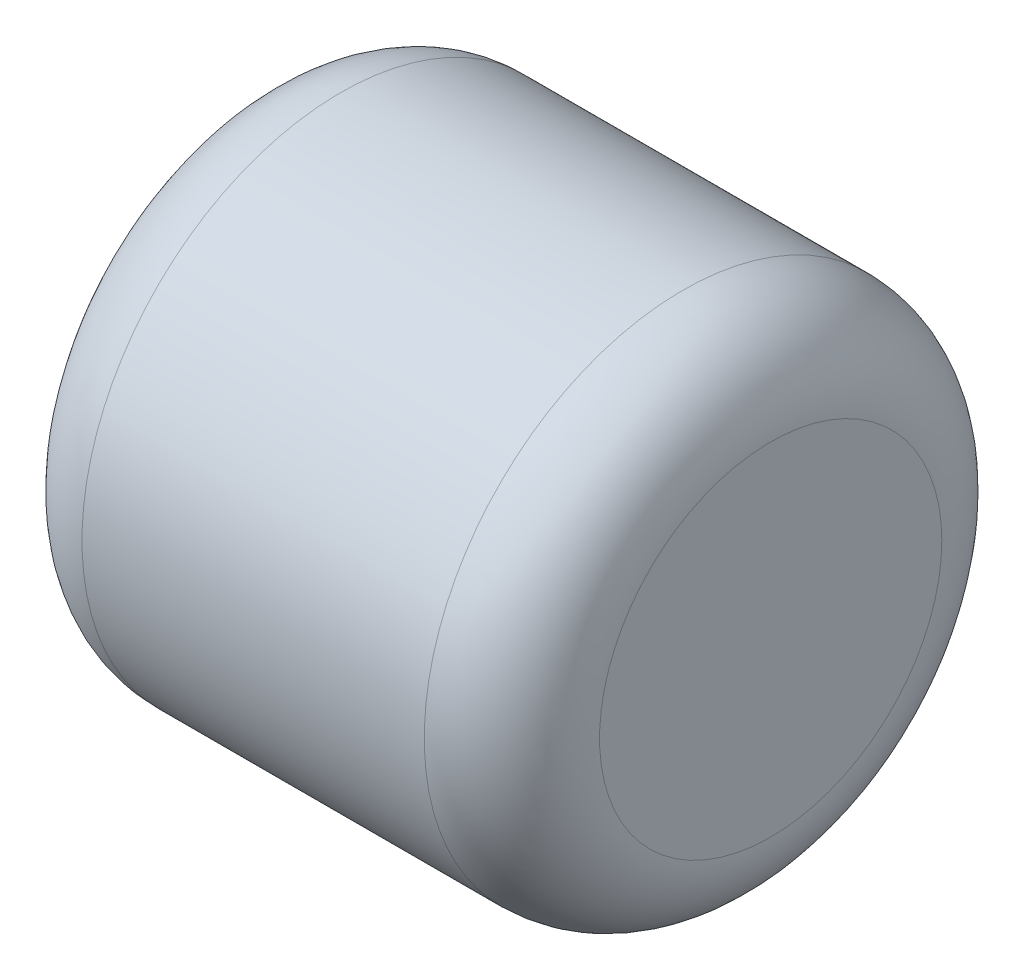
ISO-10303-21;
HEADER;
FILE_DESCRIPTION(('STEP AP214'),'2;1');
FILE_NAME('part.step','',(''),(''),'','','');
FILE_SCHEMA(('AUTOMOTIVE_DESIGN { 1 0 10303 214 1 1 1 1 }'));
ENDSEC;
DATA;
#1=APPLICATION_CONTEXT('core data for automotive mechanical design processes');
#2=APPLICATION_PROTOCOL_DEFINITION('international standard','automotive_design',2000,#1);
#3=PRODUCT_CONTEXT('',#1,'mechanical');
#4=PRODUCT('Part','Part','',(#3));
#5=PRODUCT_RELATED_PRODUCT_CATEGORY('part','',(#4));
#6=PRODUCT_DEFINITION_FORMATION('','',#4);
#7=PRODUCT_DEFINITION_CONTEXT('part definition',#1,'design');
#8=PRODUCT_DEFINITION('design','',#6,#7);
#9=PRODUCT_DEFINITION_SHAPE('','',#8);
#10=(LENGTH_UNIT() NAMED_UNIT(*) SI_UNIT(.MILLI.,.METRE.));
#11=(NAMED_UNIT(*) PLANE_ANGLE_UNIT() SI_UNIT($,.RADIAN.));
#12=(NAMED_UNIT(*) SI_UNIT($,.STERADIAN.) SOLID_ANGLE_UNIT());
#13=UNCERTAINTY_MEASURE_WITH_UNIT(LENGTH_MEASURE(1.E-05),#10,'distance_accuracy_value','');
#14=(GEOMETRIC_REPRESENTATION_CONTEXT(3) GLOBAL_UNCERTAINTY_ASSIGNED_CONTEXT((#13)) GLOBAL_UNIT_ASSIGNED_CONTEXT((#10,
#11,#12)) REPRESENTATION_CONTEXT('',''));
#15=CARTESIAN_POINT('',(0.,0.,0.));
#16=DIRECTION('',(0.,0.,1.));
#17=DIRECTION('',(1.,0.,0.));
#18=AXIS2_PLACEMENT_3D('',#15,#16,#17);
#19=CARTESIAN_POINT('',(3.,0.,0.));
#20=DIRECTION('',(-1.,0.,0.));
#21=DIRECTION('',(0.,0.,1.));
#22=AXIS2_PLACEMENT_3D('',#19,#20,#21);
#23=CYLINDRICAL_SURFACE('',#22,1.5);
#24=CARTESIAN_POINT('',(0.508,0.,0.));
#25=DIRECTION('',(1.,0.,0.));
#26=DIRECTION('',(0.,0.,-1.));
#27=AXIS2_PLACEMENT_3D('',#24,#25,#26);
#28=CIRCLE('',#27,1.5);
#29=CARTESIAN_POINT('',(0.508,0.,-1.5));
#30=VERTEX_POINT('',#29);
#31=EDGE_CURVE('E41',#30,#30,#28,.T.);
#32=ORIENTED_EDGE('',*,*,#31,.T.);
#33=EDGE_LOOP('',(#32));
#34=FACE_BOUND('',#33,.T.);
#35=CARTESIAN_POINT('',(2.492,0.,0.));
#36=DIRECTION('',(1.,0.,0.));
#37=DIRECTION('',(0.,0.,-1.));
#38=AXIS2_PLACEMENT_3D('',#35,#36,#37);
#39=CIRCLE('',#38,1.5);
#40=CARTESIAN_POINT('',(2.492,0.,-1.5));
#41=VERTEX_POINT('',#40);
#42=EDGE_CURVE('E45',#41,#41,#39,.F.);
#43=ORIENTED_EDGE('',*,*,#42,.T.);
#44=EDGE_LOOP('',(#43));
#45=FACE_BOUND('',#44,.T.);
#46=ADVANCED_FACE('F30',(#34,#45),#23,.T.);
#47=CARTESIAN_POINT('',(3.,0.,0.));
#48=DIRECTION('',(1.,0.,0.));
#49=DIRECTION('',(0.,0.,-1.));
#50=AXIS2_PLACEMENT_3D('',#47,#48,#49);
#51=PLANE('',#50);
#52=CARTESIAN_POINT('',(3.,0.,0.));
#53=DIRECTION('',(1.,0.,0.));
#54=DIRECTION('',(0.,0.,-1.));
#55=AXIS2_PLACEMENT_3D('',#52,#53,#54);
#56=CIRCLE('',#55,0.992);
#57=CARTESIAN_POINT('',(3.,0.,-0.992));
#58=VERTEX_POINT('',#57);
#59=EDGE_CURVE('E10',#58,#58,#56,.T.);
#60=ORIENTED_EDGE('',*,*,#59,.T.);
#61=EDGE_LOOP('',(#60));
#62=FACE_BOUND('',#61,.T.);
#63=ADVANCED_FACE('F61',(#62),#51,.T.);
#64=CARTESIAN_POINT('',(0.,0.,0.));
#65=DIRECTION('',(1.,0.,0.));
#66=DIRECTION('',(0.,0.,-1.));
#67=AXIS2_PLACEMENT_3D('',#64,#65,#66);
#68=PLANE('',#67);
#69=CARTESIAN_POINT('',(0.,0.,0.));
#70=DIRECTION('',(1.,0.,0.));
#71=DIRECTION('',(0.,0.,-1.));
#72=AXIS2_PLACEMENT_3D('',#69,#70,#71);
#73=CIRCLE('',#72,0.992);
#74=CARTESIAN_POINT('',(0.,0.,-0.992));
#75=VERTEX_POINT('',#74);
#76=EDGE_CURVE('E37',#75,#75,#73,.F.);
#77=ORIENTED_EDGE('',*,*,#76,.T.);
#78=EDGE_LOOP('',(#77));
#79=FACE_BOUND('',#78,.T.);
#80=ADVANCED_FACE('F58',(#79),#68,.F.);
#81=CARTESIAN_POINT('',(0.508,0.,0.));
#82=DIRECTION('',(1.,0.,0.));
#83=DIRECTION('',(0.,0.,-1.));
#84=AXIS2_PLACEMENT_3D('',#81,#82,#83);
#85=TOROIDAL_SURFACE('',#84,0.992,0.508);
#86=ORIENTED_EDGE('',*,*,#76,.F.);
#87=EDGE_LOOP('',(#86));
#88=FACE_BOUND('',#87,.T.);
#89=ORIENTED_EDGE('',*,*,#31,.F.);
#90=EDGE_LOOP('',(#89));
#91=FACE_BOUND('',#90,.T.);
#92=ADVANCED_FACE('F54',(#88,#91),#85,.T.);
#93=CARTESIAN_POINT('',(2.492,0.,0.));
#94=DIRECTION('',(1.,0.,0.));
#95=DIRECTION('',(0.,0.,-1.));
#96=AXIS2_PLACEMENT_3D('',#93,#94,#95);
#97=TOROIDAL_SURFACE('',#96,0.992,0.508);
#98=ORIENTED_EDGE('',*,*,#42,.F.);
#99=EDGE_LOOP('',(#98));
#100=FACE_BOUND('',#99,.T.);
#101=ORIENTED_EDGE('',*,*,#59,.F.);
#102=EDGE_LOOP('',(#101));
#103=FACE_BOUND('',#102,.T.);
#104=ADVANCED_FACE('F32',(#100,#103),#97,.T.);
#105=CLOSED_SHELL('',(#46,#63,#80,#92,#104));
#106=MANIFOLD_SOLID_BREP('B2',#105);
#107=ADVANCED_BREP_SHAPE_REPRESENTATION('',(#18,#106),#14);
#108=SHAPE_DEFINITION_REPRESENTATION(#9,#107);
ENDSEC;
END-ISO-10303-21;
